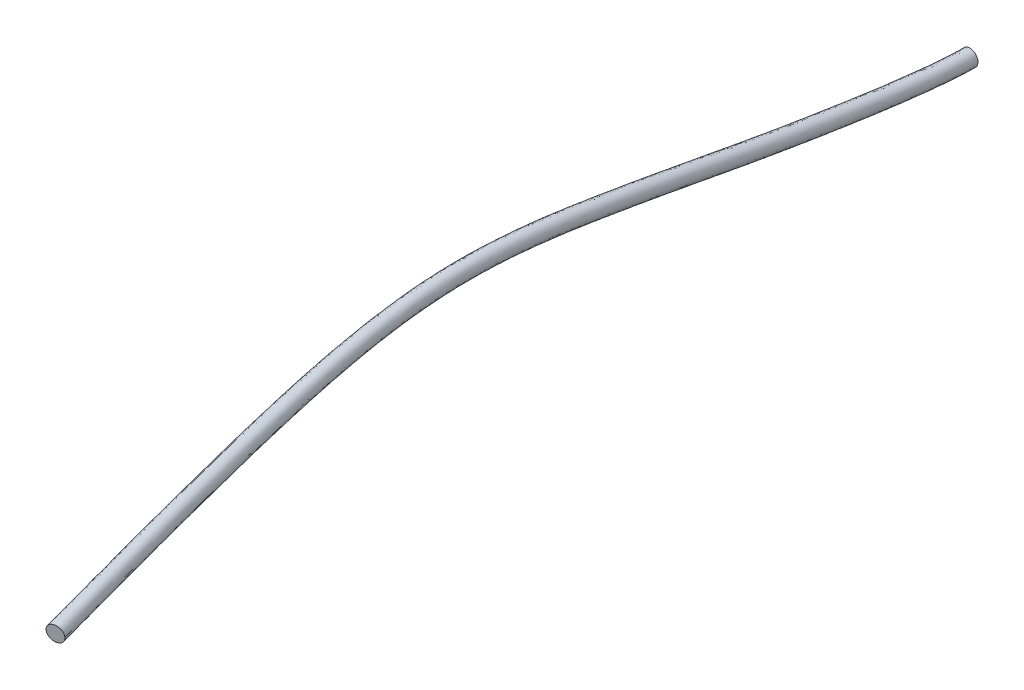
ISO-10303-21;
HEADER;
FILE_DESCRIPTION(('STEP AP214'),'2;1');
FILE_NAME('part.step','',(''),(''),'','','');
FILE_SCHEMA(('AUTOMOTIVE_DESIGN { 1 0 10303 214 1 1 1 1 }'));
ENDSEC;
DATA;
#1=APPLICATION_CONTEXT('core data for automotive mechanical design processes');
#2=APPLICATION_PROTOCOL_DEFINITION('international standard','automotive_design',2000,#1);
#3=PRODUCT_CONTEXT('',#1,'mechanical');
#4=PRODUCT('Part','Part','',(#3));
#5=PRODUCT_RELATED_PRODUCT_CATEGORY('part','',(#4));
#6=PRODUCT_DEFINITION_FORMATION('','',#4);
#7=PRODUCT_DEFINITION_CONTEXT('part definition',#1,'design');
#8=PRODUCT_DEFINITION('design','',#6,#7);
#9=PRODUCT_DEFINITION_SHAPE('','',#8);
#10=(LENGTH_UNIT() NAMED_UNIT(*) SI_UNIT(.MILLI.,.METRE.));
#11=(NAMED_UNIT(*) PLANE_ANGLE_UNIT() SI_UNIT($,.RADIAN.));
#12=(NAMED_UNIT(*) SI_UNIT($,.STERADIAN.) SOLID_ANGLE_UNIT());
#13=UNCERTAINTY_MEASURE_WITH_UNIT(LENGTH_MEASURE(1.E-05),#10,'distance_accuracy_value','');
#14=(GEOMETRIC_REPRESENTATION_CONTEXT(3) GLOBAL_UNCERTAINTY_ASSIGNED_CONTEXT((#13)) GLOBAL_UNIT_ASSIGNED_CONTEXT((#10,
#11,#12)) REPRESENTATION_CONTEXT('',''));
#15=CARTESIAN_POINT('',(0.,0.,0.));
#16=DIRECTION('',(0.,0.,1.));
#17=DIRECTION('',(1.,0.,0.));
#18=AXIS2_PLACEMENT_3D('',#15,#16,#17);
#19=CARTESIAN_POINT('',(0.,0.,0.));
#20=DIRECTION('',(0.,0.,1.));
#21=DIRECTION('',(1.,0.,0.));
#22=AXIS2_PLACEMENT_3D('',#19,#20,#21);
#23=PLANE('',#22);
#24=CARTESIAN_POINT('',(0.,0.,0.));
#25=DIRECTION('',(0.,0.,1.));
#26=DIRECTION('',(1.,0.,0.));
#27=AXIS2_PLACEMENT_3D('',#24,#25,#26);
#28=CIRCLE('',#27,1.15);
#29=CARTESIAN_POINT('',(1.15,0.,0.));
#30=VERTEX_POINT('',#29);
#31=EDGE_CURVE('E40',#30,#30,#28,.T.);
#32=ORIENTED_EDGE('',*,*,#31,.F.);
#33=EDGE_LOOP('',(#32));
#34=FACE_BOUND('',#33,.T.);
#35=ADVANCED_FACE('F33',(#34),#23,.F.);
#36=CARTESIAN_POINT('',(4.60653271399671,-1.33060596800163,134.515990322576));
#37=DIRECTION('',(0.182571577154178,-0.116237277327034,0.976297349466357));
#38=DIRECTION('',(0.983176639495091,0.0159323463009838,-0.181961138412808));
#39=AXIS2_PLACEMENT_3D('',#36,#37,#38);
#40=PLANE('',#39);
#41=CARTESIAN_POINT('',(4.60653271399671,-1.33060596800163,134.515990322576));
#42=DIRECTION('',(0.182571577154178,-0.116237277327034,0.976297349466357));
#43=DIRECTION('',(0.983176639495091,0.0159323463009838,-0.181961138412808));
#44=AXIS2_PLACEMENT_3D('',#41,#42,#43);
#45=CIRCLE('',#44,1.15);
#46=CARTESIAN_POINT('',(5.73718584941606,-1.3122837697555,134.306735013402));
#47=VERTEX_POINT('',#46);
#48=EDGE_CURVE('E11',#47,#47,#45,.T.);
#49=ORIENTED_EDGE('',*,*,#48,.T.);
#50=EDGE_LOOP('',(#49));
#51=FACE_BOUND('',#50,.T.);
#52=ADVANCED_FACE('F47',(#51),#40,.T.);
#53=CARTESIAN_POINT('',(1.15,0.,0.));
#54=CARTESIAN_POINT('',(1.14999999833914,1.55579439842038E-09,2.83630093314077));
#55=CARTESIAN_POINT('',(0.933948206695335,0.237051398429282,7.05626184927948));
#56=CARTESIAN_POINT('',(0.347417482113418,0.936245798697613,16.2424860781211));
#57=CARTESIAN_POINT('',(-0.0239253150171979,1.39935473012423,21.1987251685674));
#58=CARTESIAN_POINT('',(-0.998583203022,2.81458598575012,34.4195047617404));
#59=CARTESIAN_POINT('',(-1.40410363583115,3.74194035060327,40.2779025736796));
#60=CARTESIAN_POINT('',(-2.52664345136602,5.21452485761242,55.1113554899818));
#61=CARTESIAN_POINT('',(-3.07374785295618,5.77181184319701,62.1505387355456));
#62=CARTESIAN_POINT('',(-2.90907274382789,5.46185175698496,76.7828756802795));
#63=CARTESIAN_POINT('',(-2.34673636886395,4.76362941373253,84.2142405406296));
#64=CARTESIAN_POINT('',(0.359046508977535,2.40601837754184,104.330890435045));
#65=CARTESIAN_POINT('',(2.50278767685982,0.746950439838204,117.010864471167));
#66=CARTESIAN_POINT('',(5.73718584941606,-1.3122837697555,134.306735013402));
#67=CARTESIAN_POINT('',(1.15,2.3,0.));
#68=CARTESIAN_POINT('',(1.14999999908105,2.30000000073801,2.70650224178159));
#69=CARTESIAN_POINT('',(0.937938768916846,2.53259038155263,6.91034432725605));
#70=CARTESIAN_POINT('',(0.35501783392866,3.22748135923971,16.040028893407));
#71=CARTESIAN_POINT('',(-0.0149481698177862,3.6888952656934,20.9784994038727));
#72=CARTESIAN_POINT('',(-0.984151458523568,5.09620628298177,34.1252898696915));
#73=CARTESIAN_POINT('',(-1.39037475962491,6.02503987411845,39.9939718457644));
#74=CARTESIAN_POINT('',(-2.52003408324902,7.50696400315421,54.9215034674772));
#75=CARTESIAN_POINT('',(-3.07627844832606,8.07423434529431,62.0605276066185));
#76=CARTESIAN_POINT('',(-2.90867539967524,7.75876317454775,76.9530272370219));
#77=CARTESIAN_POINT('',(-2.33732480768335,7.05108628107959,84.4552733733445));
#78=CARTESIAN_POINT('',(0.375181107746148,4.68761798330235,104.621901152489));
#79=CARTESIAN_POINT('',(2.51802540733216,3.0295588969933,117.29306038126));
#80=CARTESIAN_POINT('',(5.75005655705727,0.971831692443814,134.576273322788));
#81=CARTESIAN_POINT('',(-1.15,2.3,0.));
#82=CARTESIAN_POINT('',(-1.15000000020836,2.29999999995582,2.58818089335886));
#83=CARTESIAN_POINT('',(-1.35855981316128,2.52866478636888,6.78225002319731));
#84=CARTESIAN_POINT('',(-1.93917481989039,3.22080669447188,15.8758192270072));
#85=CARTESIAN_POINT('',(-2.30860858364697,3.68146526928123,20.8079957703892));
#86=CARTESIAN_POINT('',(-3.27830924497206,5.08949848352443,33.9615328638905));
#87=CARTESIAN_POINT('',(-3.68435184162837,6.01798490891256,39.8276528482707));
#88=CARTESIAN_POINT('',(-4.81320782401635,7.49885520233565,54.744568966683));
#89=CARTESIAN_POINT('',(-5.37751493426225,8.0753189625483,61.9635560965392));
#90=CARTESIAN_POINT('',(-5.20731974544957,7.75496874949372,77.0863823901351));
#91=CARTESIAN_POINT('',(-4.62562647370413,7.03592018713859,84.6953858269337));
#92=CARTESIAN_POINT('',(-1.8959403475369,4.65748314941684,104.989743160071));
#93=CARTESIAN_POINT('',(0.253152151623996,2.99518548167454,117.692496629187));
#94=CARTESIAN_POINT('',(3.48875028621856,0.935187295951552,134.994783941137));
#95=CARTESIAN_POINT('',(-1.15,0.,0.));
#96=CARTESIAN_POINT('',(-1.15000000095027,7.7360610336211E-10,2.71797958471804));
#97=CARTESIAN_POINT('',(-1.36255037538279,0.233125803245536,6.92816754522074));
#98=CARTESIAN_POINT('',(-1.94677517170564,0.929571133929783,16.0782764117213));
#99=CARTESIAN_POINT('',(-2.31758572884638,1.39192473371207,21.0282215350839));
#100=CARTESIAN_POINT('',(-3.29274098947049,2.80787818629278,34.2557477559393));
#101=CARTESIAN_POINT('',(-3.69808071783263,3.73488538539936,40.1115835761859));
#102=CARTESIAN_POINT('',(-4.81981719213461,5.2064160567926,54.9344209891877));
#103=CARTESIAN_POINT('',(-5.37498433889237,5.77289646045442,62.0535672254663));
#104=CARTESIAN_POINT('',(-5.20771708960221,5.45805733192795,76.9162308333927));
#105=CARTESIAN_POINT('',(-4.63503803488363,4.74846331978931,84.4543529942188));
#106=CARTESIAN_POINT('',(-1.91207494630663,2.37588354365856,104.698732442627));
#107=CARTESIAN_POINT('',(0.237914421163183,0.712577024519449,117.410300719093));
#108=CARTESIAN_POINT('',(3.47587957857735,-1.34892816624776,134.725245631751));
#109=CARTESIAN_POINT('',(-1.15,-2.3,0.));
#110=CARTESIAN_POINT('',(-1.15000000169217,-2.29999999840861,2.84777827607722));
#111=CARTESIAN_POINT('',(-1.3665409376043,-2.06241317987781,7.07408506724417));
#112=CARTESIAN_POINT('',(-1.95437552352088,-1.36166442661231,16.2807335964354));
#113=CARTESIAN_POINT('',(-2.32656287404579,-0.897615801857099,21.2484472997787));
#114=CARTESIAN_POINT('',(-3.30717273396892,0.526257889061131,34.5499626479881));
#115=CARTESIAN_POINT('',(-3.71180959403689,1.45178586188616,40.3955143041011));
#116=CARTESIAN_POINT('',(-4.82642656025288,2.91397691124956,55.1242730116923));
#117=CARTESIAN_POINT('',(-5.3724537435225,3.47047395836053,62.1435783543933));
#118=CARTESIAN_POINT('',(-5.20811443375485,3.16114591436218,76.7460792766503));
#119=CARTESIAN_POINT('',(-4.64444959606312,2.46100645244002,84.213320161504));
#120=CARTESIAN_POINT('',(-1.92820954507635,0.0942839379002736,104.407721725183));
#121=CARTESIAN_POINT('',(0.222676690702368,-1.57003143263564,117.128104809));
#122=CARTESIAN_POINT('',(3.46300887093615,-3.63304362844708,134.455707322365));
#123=CARTESIAN_POINT('',(1.15,-2.3,0.));
#124=CARTESIAN_POINT('',(1.14999999759724,-2.29999999762642,2.96609962449996));
#125=CARTESIAN_POINT('',(0.929957644473825,-2.05848758469407,7.20217937130291));
#126=CARTESIAN_POINT('',(0.339817130298175,-1.35498976184448,16.4449432628351));
#127=CARTESIAN_POINT('',(-0.0329024602166094,-0.890185805444934,21.4189509332622));
#128=CARTESIAN_POINT('',(-1.01301494752043,0.532965688518477,34.7137196537892));
#129=CARTESIAN_POINT('',(-1.41783251203739,1.45884082708809,40.5618333015948));
#130=CARTESIAN_POINT('',(-2.53325281948302,2.92208571207064,55.3012075124864));
#131=CARTESIAN_POINT('',(-3.07121725758631,3.46938934109971,62.2405498644726));
#132=CARTESIAN_POINT('',(-2.90947008798053,3.16494033942218,76.6127241235371));
#133=CARTESIAN_POINT('',(-2.35614793004456,2.47617254638547,83.9732077079148));
#134=CARTESIAN_POINT('',(0.342911910208922,0.124418771781334,104.039879717601));
#135=CARTESIAN_POINT('',(2.48754994638747,-1.53565801731689,116.728668561074));
#136=CARTESIAN_POINT('',(5.72431514177486,-3.59639923195482,134.037196704015));
#137=CARTESIAN_POINT('',(1.15,0.,0.));
#138=CARTESIAN_POINT('',(1.14999999833914,1.55579439842038E-09,2.83630093314077));
#139=CARTESIAN_POINT('',(0.933948206695335,0.237051398429282,7.05626184927948));
#140=CARTESIAN_POINT('',(0.347417482113418,0.936245798697613,16.2424860781211));
#141=CARTESIAN_POINT('',(-0.0239253150171979,1.39935473012423,21.1987251685674));
#142=CARTESIAN_POINT('',(-0.998583203022,2.81458598575012,34.4195047617404));
#143=CARTESIAN_POINT('',(-1.40410363583115,3.74194035060327,40.2779025736796));
#144=CARTESIAN_POINT('',(-2.52664345136602,5.21452485761242,55.1113554899818));
#145=CARTESIAN_POINT('',(-3.07374785295618,5.77181184319701,62.1505387355456));
#146=CARTESIAN_POINT('',(-2.90907274382789,5.46185175698496,76.7828756802795));
#147=CARTESIAN_POINT('',(-2.34673636886395,4.76362941373253,84.2142405406296));
#148=CARTESIAN_POINT('',(0.359046508977535,2.40601837754184,104.330890435045));
#149=CARTESIAN_POINT('',(2.50278767685982,0.746950439838204,117.010864471167));
#150=CARTESIAN_POINT('',(5.73718584941606,-1.3122837697555,134.306735013402));
#151=(BOUNDED_SURFACE() B_SPLINE_SURFACE(3,3,((#53,#54,#55,#56,#57,#58,#59,#60,#61,#62,#63,#64,
#65,#66),(#67,#68,#69,#70,#71,#72,#73,#74,#75,#76,#77,#78,#79,#80),(#81,#82,#83,#84,#85,#86,#87,
#88,#89,#90,#91,#92,#93,#94),(#95,#96,#97,#98,#99,#100,#101,#102,#103,#104,#105,#106,#107,#108),
(#109,#110,#111,#112,#113,#114,#115,#116,#117,#118,#119,#120,#121,#122),(#123,#124,#125,#126,
#127,#128,#129,#130,#131,#132,#133,#134,#135,#136),(#137,#138,#139,#140,#141,#142,#143,#144,
#145,#146,#147,#148,#149,#150)),.UNSPECIFIED.,.T.,.F.,.F.) B_SPLINE_SURFACE_WITH_KNOTS((4,3,4),
(4,2,2,2,2,2,4),(0.,0.5,1.),(0.,0.127992355602088,0.255984711204176,0.525951587681623,
0.698297396141514,0.849148698070757,1.),
.UNSPECIFIED.) GEOMETRIC_REPRESENTATION_ITEM() RATIONAL_B_SPLINE_SURFACE(((1.,1.,1.,1.,1.,1.,1.,
1.,1.,1.,1.,1.,1.,1.),(0.333333333333333,0.333333333333333,0.333333333333333,0.333333333333333,
0.333333333333333,0.333333333333333,0.333333333333333,0.333333333333333,0.333333333333333,
0.333333333333333,0.333333333333333,0.333333333333333,0.333333333333333,0.333333333333333),
(0.333333333333333,0.333333333333333,0.333333333333333,0.333333333333333,0.333333333333333,
0.333333333333333,0.333333333333333,0.333333333333333,0.333333333333333,0.333333333333333,
0.333333333333333,0.333333333333333,0.333333333333333,0.333333333333333),(1.,1.,1.,1.,1.,1.,1.,
1.,1.,1.,1.,1.,1.,1.),(0.333333333333333,0.333333333333333,0.333333333333333,0.333333333333333,
0.333333333333333,0.333333333333333,0.333333333333333,0.333333333333333,0.333333333333333,
0.333333333333333,0.333333333333333,0.333333333333333,0.333333333333333,0.333333333333333),
(0.333333333333333,0.333333333333333,0.333333333333333,0.333333333333333,0.333333333333333,
0.333333333333333,0.333333333333333,0.333333333333333,0.333333333333333,0.333333333333333,
0.333333333333333,0.333333333333333,0.333333333333333,0.333333333333333),(1.,1.,1.,1.,1.,1.,1.,
1.,1.,1.,1.,1.,1.,1.))) REPRESENTATION_ITEM('') SURFACE());
#152=ORIENTED_EDGE('',*,*,#48,.F.);
#153=EDGE_LOOP('',(#152));
#154=FACE_BOUND('',#153,.T.);
#155=ORIENTED_EDGE('',*,*,#31,.T.);
#156=EDGE_LOOP('',(#155));
#157=FACE_BOUND('',#156,.T.);
#158=ADVANCED_FACE('F49',(#154,#157),#151,.T.);
#159=CLOSED_SHELL('',(#35,#52,#158));
#160=MANIFOLD_SOLID_BREP('B2',#159);
#161=ADVANCED_BREP_SHAPE_REPRESENTATION('',(#18,#160),#14);
#162=SHAPE_DEFINITION_REPRESENTATION(#9,#161);
ENDSEC;
END-ISO-10303-21;
